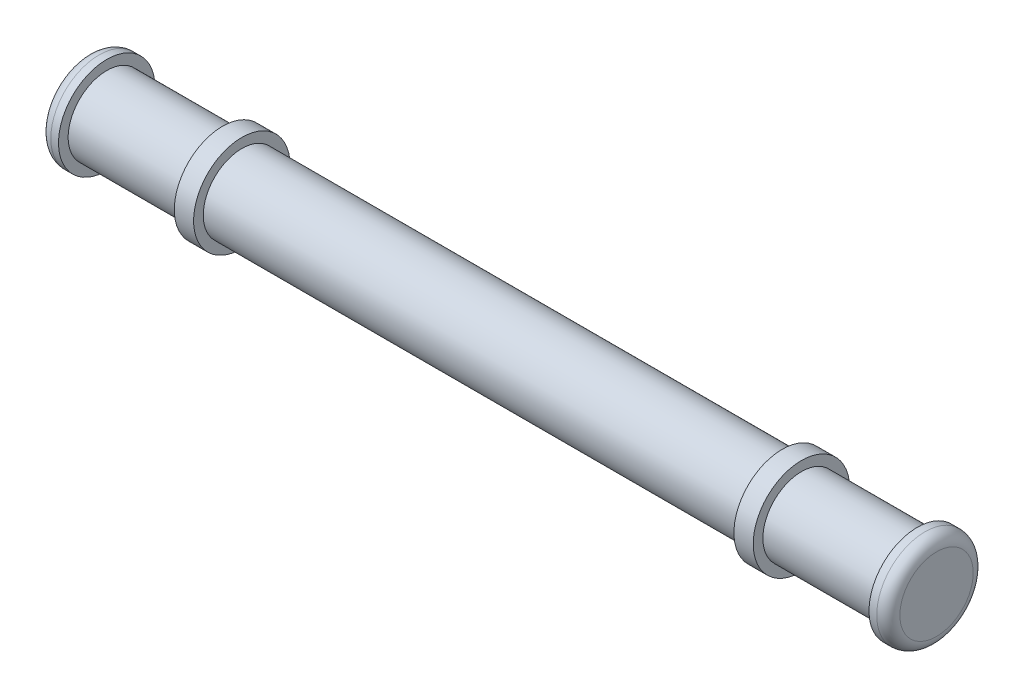
ISO-10303-21;
HEADER;
FILE_DESCRIPTION(('STEP AP214'),'2;1');
FILE_NAME('part.step','',(''),(''),'','','');
FILE_SCHEMA(('AUTOMOTIVE_DESIGN { 1 0 10303 214 1 1 1 1 }'));
ENDSEC;
DATA;
#1=APPLICATION_CONTEXT('core data for automotive mechanical design processes');
#2=APPLICATION_PROTOCOL_DEFINITION('international standard','automotive_design',2000,#1);
#3=PRODUCT_CONTEXT('',#1,'mechanical');
#4=PRODUCT('Part','Part','',(#3));
#5=PRODUCT_RELATED_PRODUCT_CATEGORY('part','',(#4));
#6=PRODUCT_DEFINITION_FORMATION('','',#4);
#7=PRODUCT_DEFINITION_CONTEXT('part definition',#1,'design');
#8=PRODUCT_DEFINITION('design','',#6,#7);
#9=PRODUCT_DEFINITION_SHAPE('','',#8);
#10=(LENGTH_UNIT() NAMED_UNIT(*) SI_UNIT(.MILLI.,.METRE.));
#11=(NAMED_UNIT(*) PLANE_ANGLE_UNIT() SI_UNIT($,.RADIAN.));
#12=(NAMED_UNIT(*) SI_UNIT($,.STERADIAN.) SOLID_ANGLE_UNIT());
#13=UNCERTAINTY_MEASURE_WITH_UNIT(LENGTH_MEASURE(1.E-05),#10,'distance_accuracy_value','');
#14=(GEOMETRIC_REPRESENTATION_CONTEXT(3) GLOBAL_UNCERTAINTY_ASSIGNED_CONTEXT((#13)) GLOBAL_UNIT_ASSIGNED_CONTEXT((#10,
#11,#12)) REPRESENTATION_CONTEXT('',''));
#15=CARTESIAN_POINT('',(0.,0.,0.));
#16=DIRECTION('',(0.,0.,1.));
#17=DIRECTION('',(1.,0.,0.));
#18=AXIS2_PLACEMENT_3D('',#15,#16,#17);
#19=CARTESIAN_POINT('',(-93.98,0.,0.));
#20=DIRECTION('',(-1.,0.,0.));
#21=DIRECTION('',(0.,0.,1.));
#22=AXIS2_PLACEMENT_3D('',#19,#20,#21);
#23=TOROIDAL_SURFACE('',#22,24.13,7.62);
#24=CARTESIAN_POINT('',(-101.6,0.,0.));
#25=DIRECTION('',(-1.,0.,0.));
#26=DIRECTION('',(0.,0.,1.));
#27=AXIS2_PLACEMENT_3D('',#24,#25,#26);
#28=CIRCLE('',#27,24.13);
#29=CARTESIAN_POINT('',(-101.6,0.,24.13));
#30=VERTEX_POINT('',#29);
#31=EDGE_CURVE('E59',#30,#30,#28,.T.);
#32=ORIENTED_EDGE('',*,*,#31,.F.);
#33=EDGE_LOOP('',(#32));
#34=FACE_BOUND('',#33,.T.);
#35=CARTESIAN_POINT('',(-93.98,0.,0.));
#36=DIRECTION('',(-1.,0.,0.));
#37=DIRECTION('',(0.,0.,1.));
#38=AXIS2_PLACEMENT_3D('',#35,#36,#37);
#39=CIRCLE('',#38,31.75);
#40=CARTESIAN_POINT('',(-93.98,0.,31.75));
#41=VERTEX_POINT('',#40);
#42=EDGE_CURVE('E12',#41,#41,#39,.F.);
#43=ORIENTED_EDGE('',*,*,#42,.F.);
#44=EDGE_LOOP('',(#43));
#45=FACE_BOUND('',#44,.T.);
#46=ADVANCED_FACE('F52',(#34,#45),#23,.T.);
#47=CARTESIAN_POINT('',(449.58,0.,0.));
#48=DIRECTION('',(1.,0.,0.));
#49=DIRECTION('',(0.,0.,-1.));
#50=AXIS2_PLACEMENT_3D('',#47,#48,#49);
#51=TOROIDAL_SURFACE('',#50,24.13,7.62);
#52=CARTESIAN_POINT('',(457.2,0.,0.));
#53=DIRECTION('',(1.,0.,0.));
#54=DIRECTION('',(0.,0.,-1.));
#55=AXIS2_PLACEMENT_3D('',#52,#53,#54);
#56=CIRCLE('',#55,24.13);
#57=CARTESIAN_POINT('',(457.2,0.,-24.13));
#58=VERTEX_POINT('',#57);
#59=EDGE_CURVE('E69',#58,#58,#56,.T.);
#60=ORIENTED_EDGE('',*,*,#59,.F.);
#61=EDGE_LOOP('',(#60));
#62=FACE_BOUND('',#61,.T.);
#63=CARTESIAN_POINT('',(449.58,0.,0.));
#64=DIRECTION('',(1.,0.,0.));
#65=DIRECTION('',(0.,0.,-1.));
#66=AXIS2_PLACEMENT_3D('',#63,#64,#65);
#67=CIRCLE('',#66,31.75);
#68=CARTESIAN_POINT('',(449.58,0.,-31.75));
#69=VERTEX_POINT('',#68);
#70=EDGE_CURVE('E64',#69,#69,#67,.F.);
#71=ORIENTED_EDGE('',*,*,#70,.F.);
#72=EDGE_LOOP('',(#71));
#73=FACE_BOUND('',#72,.T.);
#74=ADVANCED_FACE('F141',(#62,#73),#51,.T.);
#75=CARTESIAN_POINT('',(355.6,0.,0.));
#76=DIRECTION('',(-1.,0.,0.));
#77=DIRECTION('',(0.,0.,1.));
#78=AXIS2_PLACEMENT_3D('',#75,#76,#77);
#79=CYLINDRICAL_SURFACE('',#78,25.4);
#80=CARTESIAN_POINT('',(355.6,0.,0.));
#81=DIRECTION('',(1.,0.,0.));
#82=DIRECTION('',(0.,0.,-1.));
#83=AXIS2_PLACEMENT_3D('',#80,#81,#82);
#84=CIRCLE('',#83,25.4);
#85=CARTESIAN_POINT('',(355.6,0.,-25.4));
#86=VERTEX_POINT('',#85);
#87=EDGE_CURVE('E82',#86,#86,#84,.T.);
#88=ORIENTED_EDGE('',*,*,#87,.F.);
#89=EDGE_LOOP('',(#88));
#90=FACE_BOUND('',#89,.T.);
#91=CARTESIAN_POINT('',(0.,0.,0.));
#92=DIRECTION('',(1.,0.,0.));
#93=DIRECTION('',(0.,0.,-1.));
#94=AXIS2_PLACEMENT_3D('',#91,#92,#93);
#95=CIRCLE('',#94,25.4);
#96=CARTESIAN_POINT('',(0.,0.,-25.4));
#97=VERTEX_POINT('',#96);
#98=EDGE_CURVE('E76',#97,#97,#95,.T.);
#99=ORIENTED_EDGE('',*,*,#98,.T.);
#100=EDGE_LOOP('',(#99));
#101=FACE_BOUND('',#100,.T.);
#102=ADVANCED_FACE('F146',(#90,#101),#79,.T.);
#103=CARTESIAN_POINT('',(368.3,0.,0.));
#104=DIRECTION('',(-1.,0.,0.));
#105=DIRECTION('',(0.,0.,1.));
#106=AXIS2_PLACEMENT_3D('',#103,#104,#105);
#107=CYLINDRICAL_SURFACE('',#106,31.75);
#108=CARTESIAN_POINT('',(368.3,0.,0.));
#109=DIRECTION('',(1.,0.,0.));
#110=DIRECTION('',(0.,0.,-1.));
#111=AXIS2_PLACEMENT_3D('',#108,#109,#110);
#112=CIRCLE('',#111,31.75);
#113=CARTESIAN_POINT('',(368.3,0.,-31.75));
#114=VERTEX_POINT('',#113);
#115=EDGE_CURVE('E86',#114,#114,#112,.T.);
#116=ORIENTED_EDGE('',*,*,#115,.F.);
#117=EDGE_LOOP('',(#116));
#118=FACE_BOUND('',#117,.T.);
#119=CARTESIAN_POINT('',(355.6,0.,0.));
#120=DIRECTION('',(1.,0.,0.));
#121=DIRECTION('',(0.,0.,-1.));
#122=AXIS2_PLACEMENT_3D('',#119,#120,#121);
#123=CIRCLE('',#122,31.75);
#124=CARTESIAN_POINT('',(355.6,0.,-31.75));
#125=VERTEX_POINT('',#124);
#126=EDGE_CURVE('E87',#125,#125,#123,.T.);
#127=ORIENTED_EDGE('',*,*,#126,.T.);
#128=EDGE_LOOP('',(#127));
#129=FACE_BOUND('',#128,.T.);
#130=ADVANCED_FACE('F152',(#118,#129),#107,.T.);
#131=CARTESIAN_POINT('',(368.3,0.,0.));
#132=DIRECTION('',(1.,0.,0.));
#133=DIRECTION('',(0.,0.,-1.));
#134=AXIS2_PLACEMENT_3D('',#131,#132,#133);
#135=PLANE('',#134);
#136=CARTESIAN_POINT('',(368.3,0.,0.));
#137=DIRECTION('',(1.,0.,0.));
#138=DIRECTION('',(0.,0.,-1.));
#139=AXIS2_PLACEMENT_3D('',#136,#137,#138);
#140=CIRCLE('',#139,25.4);
#141=CARTESIAN_POINT('',(368.3,0.,-25.4));
#142=VERTEX_POINT('',#141);
#143=EDGE_CURVE('E75',#142,#142,#140,.T.);
#144=ORIENTED_EDGE('',*,*,#143,.F.);
#145=EDGE_LOOP('',(#144));
#146=FACE_BOUND('',#145,.T.);
#147=ORIENTED_EDGE('',*,*,#115,.T.);
#148=EDGE_LOOP('',(#147));
#149=FACE_BOUND('',#148,.T.);
#150=ADVANCED_FACE('F160',(#146,#149),#135,.T.);
#151=CARTESIAN_POINT('',(355.6,0.,0.));
#152=DIRECTION('',(1.,0.,0.));
#153=DIRECTION('',(0.,0.,-1.));
#154=AXIS2_PLACEMENT_3D('',#151,#152,#153);
#155=PLANE('',#154);
#156=ORIENTED_EDGE('',*,*,#87,.T.);
#157=EDGE_LOOP('',(#156));
#158=FACE_BOUND('',#157,.T.);
#159=ORIENTED_EDGE('',*,*,#126,.F.);
#160=EDGE_LOOP('',(#159));
#161=FACE_BOUND('',#160,.T.);
#162=ADVANCED_FACE('F162',(#158,#161),#155,.F.);
#163=CARTESIAN_POINT('',(444.5,0.,0.));
#164=DIRECTION('',(-1.,0.,0.));
#165=DIRECTION('',(0.,0.,1.));
#166=AXIS2_PLACEMENT_3D('',#163,#164,#165);
#167=CYLINDRICAL_SURFACE('',#166,25.4);
#168=CARTESIAN_POINT('',(444.5,0.,0.));
#169=DIRECTION('',(1.,0.,0.));
#170=DIRECTION('',(0.,0.,-1.));
#171=AXIS2_PLACEMENT_3D('',#168,#169,#170);
#172=CIRCLE('',#171,25.4);
#173=CARTESIAN_POINT('',(444.5,0.,-25.4));
#174=VERTEX_POINT('',#173);
#175=EDGE_CURVE('E91',#174,#174,#172,.T.);
#176=ORIENTED_EDGE('',*,*,#175,.F.);
#177=EDGE_LOOP('',(#176));
#178=FACE_BOUND('',#177,.T.);
#179=ORIENTED_EDGE('',*,*,#143,.T.);
#180=EDGE_LOOP('',(#179));
#181=FACE_BOUND('',#180,.T.);
#182=ADVANCED_FACE('F165',(#178,#181),#167,.T.);
#183=CARTESIAN_POINT('',(457.2,0.,0.));
#184=DIRECTION('',(-1.,0.,0.));
#185=DIRECTION('',(0.,0.,1.));
#186=AXIS2_PLACEMENT_3D('',#183,#184,#185);
#187=CYLINDRICAL_SURFACE('',#186,31.75);
#188=ORIENTED_EDGE('',*,*,#70,.T.);
#189=EDGE_LOOP('',(#188));
#190=FACE_BOUND('',#189,.T.);
#191=CARTESIAN_POINT('',(444.5,0.,0.));
#192=DIRECTION('',(1.,0.,0.));
#193=DIRECTION('',(0.,0.,-1.));
#194=AXIS2_PLACEMENT_3D('',#191,#192,#193);
#195=CIRCLE('',#194,31.75);
#196=CARTESIAN_POINT('',(444.5,0.,-31.75));
#197=VERTEX_POINT('',#196);
#198=EDGE_CURVE('E80',#197,#197,#195,.T.);
#199=ORIENTED_EDGE('',*,*,#198,.T.);
#200=EDGE_LOOP('',(#199));
#201=FACE_BOUND('',#200,.T.);
#202=ADVANCED_FACE('F172',(#190,#201),#187,.T.);
#203=CARTESIAN_POINT('',(457.2,0.,0.));
#204=DIRECTION('',(1.,0.,0.));
#205=DIRECTION('',(0.,0.,-1.));
#206=AXIS2_PLACEMENT_3D('',#203,#204,#205);
#207=PLANE('',#206);
#208=ORIENTED_EDGE('',*,*,#59,.T.);
#209=EDGE_LOOP('',(#208));
#210=FACE_BOUND('',#209,.T.);
#211=ADVANCED_FACE('F176',(#210),#207,.T.);
#212=CARTESIAN_POINT('',(444.5,0.,0.));
#213=DIRECTION('',(1.,0.,0.));
#214=DIRECTION('',(0.,0.,-1.));
#215=AXIS2_PLACEMENT_3D('',#212,#213,#214);
#216=PLANE('',#215);
#217=ORIENTED_EDGE('',*,*,#175,.T.);
#218=EDGE_LOOP('',(#217));
#219=FACE_BOUND('',#218,.T.);
#220=ORIENTED_EDGE('',*,*,#198,.F.);
#221=EDGE_LOOP('',(#220));
#222=FACE_BOUND('',#221,.T.);
#223=ADVANCED_FACE('F178',(#219,#222),#216,.F.);
#224=CARTESIAN_POINT('',(-12.7,0.,0.));
#225=DIRECTION('',(1.,0.,0.));
#226=DIRECTION('',(0.,0.,-1.));
#227=AXIS2_PLACEMENT_3D('',#224,#225,#226);
#228=CYLINDRICAL_SURFACE('',#227,31.75);
#229=CARTESIAN_POINT('',(-12.7,0.,0.));
#230=DIRECTION('',(1.,0.,0.));
#231=DIRECTION('',(0.,0.,-1.));
#232=AXIS2_PLACEMENT_3D('',#229,#230,#231);
#233=CIRCLE('',#232,31.75);
#234=CARTESIAN_POINT('',(-12.7,0.,-31.75));
#235=VERTEX_POINT('',#234);
#236=EDGE_CURVE('E81',#235,#235,#233,.T.);
#237=ORIENTED_EDGE('',*,*,#236,.T.);
#238=EDGE_LOOP('',(#237));
#239=FACE_BOUND('',#238,.T.);
#240=CARTESIAN_POINT('',(0.,0.,0.));
#241=DIRECTION('',(1.,0.,0.));
#242=DIRECTION('',(0.,0.,-1.));
#243=AXIS2_PLACEMENT_3D('',#240,#241,#242);
#244=CIRCLE('',#243,31.75);
#245=CARTESIAN_POINT('',(0.,0.,-31.75));
#246=VERTEX_POINT('',#245);
#247=EDGE_CURVE('E104',#246,#246,#244,.T.);
#248=ORIENTED_EDGE('',*,*,#247,.F.);
#249=EDGE_LOOP('',(#248));
#250=FACE_BOUND('',#249,.T.);
#251=ADVANCED_FACE('F181',(#239,#250),#228,.T.);
#252=CARTESIAN_POINT('',(-12.7,0.,0.));
#253=DIRECTION('',(-1.,0.,0.));
#254=DIRECTION('',(0.,0.,-1.));
#255=AXIS2_PLACEMENT_3D('',#252,#253,#254);
#256=PLANE('',#255);
#257=CARTESIAN_POINT('',(-12.7,0.,0.));
#258=DIRECTION('',(1.,0.,0.));
#259=DIRECTION('',(0.,0.,-1.));
#260=AXIS2_PLACEMENT_3D('',#257,#258,#259);
#261=CIRCLE('',#260,25.4);
#262=CARTESIAN_POINT('',(-12.7,0.,-25.4));
#263=VERTEX_POINT('',#262);
#264=EDGE_CURVE('E108',#263,#263,#261,.T.);
#265=ORIENTED_EDGE('',*,*,#264,.T.);
#266=EDGE_LOOP('',(#265));
#267=FACE_BOUND('',#266,.T.);
#268=ORIENTED_EDGE('',*,*,#236,.F.);
#269=EDGE_LOOP('',(#268));
#270=FACE_BOUND('',#269,.T.);
#271=ADVANCED_FACE('F188',(#267,#270),#256,.T.);
#272=CARTESIAN_POINT('',(0.,0.,0.));
#273=DIRECTION('',(-1.,0.,0.));
#274=DIRECTION('',(0.,0.,-1.));
#275=AXIS2_PLACEMENT_3D('',#272,#273,#274);
#276=PLANE('',#275);
#277=ORIENTED_EDGE('',*,*,#98,.F.);
#278=EDGE_LOOP('',(#277));
#279=FACE_BOUND('',#278,.T.);
#280=ORIENTED_EDGE('',*,*,#247,.T.);
#281=EDGE_LOOP('',(#280));
#282=FACE_BOUND('',#281,.T.);
#283=ADVANCED_FACE('F136',(#279,#282),#276,.F.);
#284=CARTESIAN_POINT('',(-88.9,0.,0.));
#285=DIRECTION('',(1.,0.,0.));
#286=DIRECTION('',(0.,0.,-1.));
#287=AXIS2_PLACEMENT_3D('',#284,#285,#286);
#288=CYLINDRICAL_SURFACE('',#287,25.4);
#289=CARTESIAN_POINT('',(-88.9,0.,0.));
#290=DIRECTION('',(1.,0.,0.));
#291=DIRECTION('',(0.,0.,-1.));
#292=AXIS2_PLACEMENT_3D('',#289,#290,#291);
#293=CIRCLE('',#292,25.4);
#294=CARTESIAN_POINT('',(-88.9,0.,-25.4));
#295=VERTEX_POINT('',#294);
#296=EDGE_CURVE('E115',#295,#295,#293,.T.);
#297=ORIENTED_EDGE('',*,*,#296,.T.);
#298=EDGE_LOOP('',(#297));
#299=FACE_BOUND('',#298,.T.);
#300=ORIENTED_EDGE('',*,*,#264,.F.);
#301=EDGE_LOOP('',(#300));
#302=FACE_BOUND('',#301,.T.);
#303=ADVANCED_FACE('F129',(#299,#302),#288,.T.);
#304=CARTESIAN_POINT('',(-101.6,0.,0.));
#305=DIRECTION('',(1.,0.,0.));
#306=DIRECTION('',(0.,0.,-1.));
#307=AXIS2_PLACEMENT_3D('',#304,#305,#306);
#308=CYLINDRICAL_SURFACE('',#307,31.75);
#309=ORIENTED_EDGE('',*,*,#42,.T.);
#310=EDGE_LOOP('',(#309));
#311=FACE_BOUND('',#310,.T.);
#312=CARTESIAN_POINT('',(-88.9,0.,0.));
#313=DIRECTION('',(1.,0.,0.));
#314=DIRECTION('',(0.,0.,-1.));
#315=AXIS2_PLACEMENT_3D('',#312,#313,#314);
#316=CIRCLE('',#315,31.75);
#317=CARTESIAN_POINT('',(-88.9,0.,-31.75));
#318=VERTEX_POINT('',#317);
#319=EDGE_CURVE('E119',#318,#318,#316,.T.);
#320=ORIENTED_EDGE('',*,*,#319,.F.);
#321=EDGE_LOOP('',(#320));
#322=FACE_BOUND('',#321,.T.);
#323=ADVANCED_FACE('F126',(#311,#322),#308,.T.);
#324=CARTESIAN_POINT('',(-101.6,0.,0.));
#325=DIRECTION('',(-1.,0.,0.));
#326=DIRECTION('',(0.,0.,-1.));
#327=AXIS2_PLACEMENT_3D('',#324,#325,#326);
#328=PLANE('',#327);
#329=ORIENTED_EDGE('',*,*,#31,.T.);
#330=EDGE_LOOP('',(#329));
#331=FACE_BOUND('',#330,.T.);
#332=ADVANCED_FACE('F128',(#331),#328,.T.);
#333=CARTESIAN_POINT('',(-88.9,0.,0.));
#334=DIRECTION('',(-1.,0.,0.));
#335=DIRECTION('',(0.,0.,-1.));
#336=AXIS2_PLACEMENT_3D('',#333,#334,#335);
#337=PLANE('',#336);
#338=ORIENTED_EDGE('',*,*,#296,.F.);
#339=EDGE_LOOP('',(#338));
#340=FACE_BOUND('',#339,.T.);
#341=ORIENTED_EDGE('',*,*,#319,.T.);
#342=EDGE_LOOP('',(#341));
#343=FACE_BOUND('',#342,.T.);
#344=ADVANCED_FACE('F124',(#340,#343),#337,.F.);
#345=CLOSED_SHELL('',(#46,#74,#102,#130,#150,#162,#182,#202,#211,#223,#251,#271,#283,#303,#323,
#332,#344));
#346=MANIFOLD_SOLID_BREP('B2',#345);
#347=ADVANCED_BREP_SHAPE_REPRESENTATION('',(#18,#346),#14);
#348=SHAPE_DEFINITION_REPRESENTATION(#9,#347);
ENDSEC;
END-ISO-10303-21;
